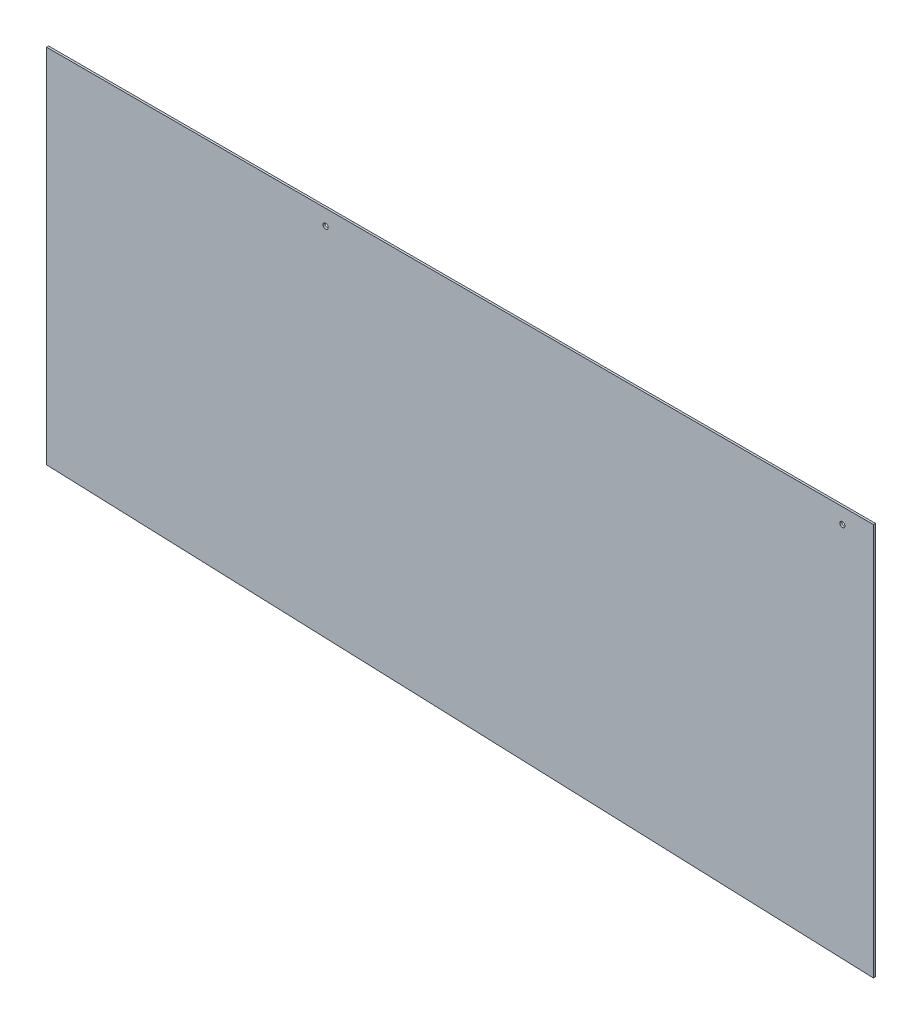
ISO-10303-21;
HEADER;
FILE_DESCRIPTION(('STEP AP214'),'2;1');
FILE_NAME('part.step','',(''),(''),'','','');
FILE_SCHEMA(('AUTOMOTIVE_DESIGN { 1 0 10303 214 1 1 1 1 }'));
ENDSEC;
DATA;
#1=APPLICATION_CONTEXT('core data for automotive mechanical design processes');
#2=APPLICATION_PROTOCOL_DEFINITION('international standard','automotive_design',2000,#1);
#3=PRODUCT_CONTEXT('',#1,'mechanical');
#4=PRODUCT('Part','Part','',(#3));
#5=PRODUCT_RELATED_PRODUCT_CATEGORY('part','',(#4));
#6=PRODUCT_DEFINITION_FORMATION('','',#4);
#7=PRODUCT_DEFINITION_CONTEXT('part definition',#1,'design');
#8=PRODUCT_DEFINITION('design','',#6,#7);
#9=PRODUCT_DEFINITION_SHAPE('','',#8);
#10=(LENGTH_UNIT() NAMED_UNIT(*) SI_UNIT(.MILLI.,.METRE.));
#11=(NAMED_UNIT(*) PLANE_ANGLE_UNIT() SI_UNIT($,.RADIAN.));
#12=(NAMED_UNIT(*) SI_UNIT($,.STERADIAN.) SOLID_ANGLE_UNIT());
#13=UNCERTAINTY_MEASURE_WITH_UNIT(LENGTH_MEASURE(1.E-05),#10,'distance_accuracy_value','');
#14=(GEOMETRIC_REPRESENTATION_CONTEXT(3) GLOBAL_UNCERTAINTY_ASSIGNED_CONTEXT((#13)) GLOBAL_UNIT_ASSIGNED_CONTEXT((#10,
#11,#12)) REPRESENTATION_CONTEXT('',''));
#15=CARTESIAN_POINT('',(0.,0.,0.));
#16=DIRECTION('',(0.,0.,1.));
#17=DIRECTION('',(1.,0.,0.));
#18=AXIS2_PLACEMENT_3D('',#15,#16,#17);
#19=CARTESIAN_POINT('',(0.,0.,0.2));
#20=DIRECTION('',(0.,0.,-1.));
#21=DIRECTION('',(-1.,0.,0.));
#22=AXIS2_PLACEMENT_3D('',#19,#20,#21);
#23=PLANE('',#22);
#24=CARTESIAN_POINT('',(-4.81258894362342,12.5444444444444,0.2));
#25=DIRECTION('',(0.,0.,1.));
#26=DIRECTION('',(1.,0.,0.));
#27=AXIS2_PLACEMENT_3D('',#24,#25,#26);
#28=CIRCLE('',#27,0.25);
#29=CARTESIAN_POINT('',(-4.56258894362342,12.5444444444444,0.2));
#30=VERTEX_POINT('',#29);
#31=EDGE_CURVE('E106',#30,#30,#28,.T.);
#32=ORIENTED_EDGE('',*,*,#31,.F.);
#33=EDGE_LOOP('',(#32));
#34=FACE_BOUND('',#33,.T.);
#35=DIRECTION('',(0.,-1.,0.));
#36=VECTOR('',#35,1.);
#37=CARTESIAN_POINT('',(-31.8125889436234,-20.9555555555556,0.2));
#38=LINE('',#37,#36);
#39=CARTESIAN_POINT('',(-31.8125889436234,14.0444444444444,0.2));
#40=VERTEX_POINT('',#39);
#41=CARTESIAN_POINT('',(-31.8125889436234,-20.9555555555556,0.2));
#42=VERTEX_POINT('',#41);
#43=EDGE_CURVE('E77',#40,#42,#38,.T.);
#44=ORIENTED_EDGE('',*,*,#43,.T.);
#45=DIRECTION('',(0.999297615709181,-0.0374736605890943,0.));
#46=VECTOR('',#45,1.);
#47=CARTESIAN_POINT('',(-31.8125889436234,-20.9555555555556,0.2));
#48=LINE('',#47,#46);
#49=CARTESIAN_POINT('',(48.1874110563766,-23.9555555555556,0.2));
#50=VERTEX_POINT('',#49);
#51=EDGE_CURVE('E81',#42,#50,#48,.T.);
#52=ORIENTED_EDGE('',*,*,#51,.T.);
#53=DIRECTION('',(0.,1.,0.));
#54=VECTOR('',#53,1.);
#55=CARTESIAN_POINT('',(48.1874110563766,14.0444444444444,0.2));
#56=LINE('',#55,#54);
#57=CARTESIAN_POINT('',(48.1874110563766,14.0444444444444,0.2));
#58=VERTEX_POINT('',#57);
#59=EDGE_CURVE('E84',#50,#58,#56,.T.);
#60=ORIENTED_EDGE('',*,*,#59,.T.);
#61=DIRECTION('',(-1.,0.,0.));
#62=VECTOR('',#61,1.);
#63=CARTESIAN_POINT('',(-31.8125889436234,14.0444444444444,0.2));
#64=LINE('',#63,#62);
#65=EDGE_CURVE('E50',#58,#40,#64,.T.);
#66=ORIENTED_EDGE('',*,*,#65,.T.);
#67=EDGE_LOOP('',(#44,#52,#60,#66));
#68=FACE_BOUND('',#67,.T.);
#69=CARTESIAN_POINT('',(45.1874110563766,12.5444444444444,0.2));
#70=DIRECTION('',(0.,0.,1.));
#71=DIRECTION('',(1.,0.,0.));
#72=AXIS2_PLACEMENT_3D('',#69,#70,#71);
#73=CIRCLE('',#72,0.25);
#74=CARTESIAN_POINT('',(45.4374110563766,12.5444444444444,0.2));
#75=VERTEX_POINT('',#74);
#76=EDGE_CURVE('E100',#75,#75,#73,.T.);
#77=ORIENTED_EDGE('',*,*,#76,.F.);
#78=EDGE_LOOP('',(#77));
#79=FACE_BOUND('',#78,.T.);
#80=ADVANCED_FACE('F33',(#34,#68,#79),#23,.F.);
#81=CARTESIAN_POINT('',(0.,0.,0.));
#82=DIRECTION('',(0.,0.,-1.));
#83=DIRECTION('',(-1.,0.,0.));
#84=AXIS2_PLACEMENT_3D('',#81,#82,#83);
#85=PLANE('',#84);
#86=CARTESIAN_POINT('',(-4.81258894362342,12.5444444444444,0.));
#87=DIRECTION('',(0.,0.,1.));
#88=DIRECTION('',(1.,0.,0.));
#89=AXIS2_PLACEMENT_3D('',#86,#87,#88);
#90=CIRCLE('',#89,0.25);
#91=CARTESIAN_POINT('',(-4.56258894362342,12.5444444444444,0.));
#92=VERTEX_POINT('',#91);
#93=EDGE_CURVE('E103',#92,#92,#90,.T.);
#94=ORIENTED_EDGE('',*,*,#93,.T.);
#95=EDGE_LOOP('',(#94));
#96=FACE_BOUND('',#95,.T.);
#97=DIRECTION('',(0.,-1.,0.));
#98=VECTOR('',#97,1.);
#99=CARTESIAN_POINT('',(-31.8125889436234,-20.9555555555556,0.));
#100=LINE('',#99,#98);
#101=CARTESIAN_POINT('',(-31.8125889436234,14.0444444444444,0.));
#102=VERTEX_POINT('',#101);
#103=CARTESIAN_POINT('',(-31.8125889436234,-20.9555555555556,0.));
#104=VERTEX_POINT('',#103);
#105=EDGE_CURVE('E88',#102,#104,#100,.T.);
#106=ORIENTED_EDGE('',*,*,#105,.F.);
#107=DIRECTION('',(-1.,0.,0.));
#108=VECTOR('',#107,1.);
#109=CARTESIAN_POINT('',(-31.8125889436234,14.0444444444444,0.));
#110=LINE('',#109,#108);
#111=CARTESIAN_POINT('',(48.1874110563766,14.0444444444444,0.));
#112=VERTEX_POINT('',#111);
#113=EDGE_CURVE('E85',#112,#102,#110,.T.);
#114=ORIENTED_EDGE('',*,*,#113,.F.);
#115=DIRECTION('',(0.,1.,0.));
#116=VECTOR('',#115,1.);
#117=CARTESIAN_POINT('',(48.1874110563766,14.0444444444444,0.));
#118=LINE('',#117,#116);
#119=CARTESIAN_POINT('',(48.1874110563766,-23.9555555555556,0.));
#120=VERTEX_POINT('',#119);
#121=EDGE_CURVE('E62',#120,#112,#118,.T.);
#122=ORIENTED_EDGE('',*,*,#121,.F.);
#123=DIRECTION('',(0.999297615709181,-0.0374736605890943,0.));
#124=VECTOR('',#123,1.);
#125=CARTESIAN_POINT('',(-31.8125889436234,-20.9555555555556,0.));
#126=LINE('',#125,#124);
#127=EDGE_CURVE('E94',#104,#120,#126,.T.);
#128=ORIENTED_EDGE('',*,*,#127,.F.);
#129=EDGE_LOOP('',(#106,#114,#122,#128));
#130=FACE_BOUND('',#129,.T.);
#131=CARTESIAN_POINT('',(45.1874110563766,12.5444444444444,0.));
#132=DIRECTION('',(0.,0.,1.));
#133=DIRECTION('',(1.,0.,0.));
#134=AXIS2_PLACEMENT_3D('',#131,#132,#133);
#135=CIRCLE('',#134,0.25);
#136=CARTESIAN_POINT('',(45.4374110563766,12.5444444444444,0.));
#137=VERTEX_POINT('',#136);
#138=EDGE_CURVE('E99',#137,#137,#135,.T.);
#139=ORIENTED_EDGE('',*,*,#138,.T.);
#140=EDGE_LOOP('',(#139));
#141=FACE_BOUND('',#140,.T.);
#142=ADVANCED_FACE('F119',(#96,#130,#141),#85,.T.);
#143=CARTESIAN_POINT('',(-31.8125889436234,-20.9555555555556,0.2));
#144=DIRECTION('',(1.,0.,0.));
#145=DIRECTION('',(0.,0.,-1.));
#146=AXIS2_PLACEMENT_3D('',#143,#144,#145);
#147=PLANE('',#146);
#148=ORIENTED_EDGE('',*,*,#105,.T.);
#149=DIRECTION('',(0.,0.,-1.));
#150=VECTOR('',#149,1.);
#151=CARTESIAN_POINT('',(-31.8125889436234,-20.9555555555556,0.2));
#152=LINE('',#151,#150);
#153=EDGE_CURVE('E11',#42,#104,#152,.T.);
#154=ORIENTED_EDGE('',*,*,#153,.F.);
#155=ORIENTED_EDGE('',*,*,#43,.F.);
#156=DIRECTION('',(0.,0.,-1.));
#157=VECTOR('',#156,1.);
#158=CARTESIAN_POINT('',(-31.8125889436234,14.0444444444444,0.2));
#159=LINE('',#158,#157);
#160=EDGE_CURVE('E113',#40,#102,#159,.T.);
#161=ORIENTED_EDGE('',*,*,#160,.T.);
#162=EDGE_LOOP('',(#148,#154,#155,#161));
#163=FACE_BOUND('',#162,.T.);
#164=ADVANCED_FACE('F35',(#163),#147,.F.);
#165=CARTESIAN_POINT('',(48.1874110563766,14.0444444444444,0.2));
#166=DIRECTION('',(-1.,0.,0.));
#167=DIRECTION('',(0.,0.,1.));
#168=AXIS2_PLACEMENT_3D('',#165,#166,#167);
#169=PLANE('',#168);
#170=ORIENTED_EDGE('',*,*,#121,.T.);
#171=DIRECTION('',(0.,0.,-1.));
#172=VECTOR('',#171,1.);
#173=CARTESIAN_POINT('',(48.1874110563766,14.0444444444444,0.2));
#174=LINE('',#173,#172);
#175=EDGE_CURVE('E42',#58,#112,#174,.T.);
#176=ORIENTED_EDGE('',*,*,#175,.F.);
#177=ORIENTED_EDGE('',*,*,#59,.F.);
#178=DIRECTION('',(0.,0.,1.));
#179=VECTOR('',#178,1.);
#180=CARTESIAN_POINT('',(48.1874110563766,-23.9555555555556,0.));
#181=LINE('',#180,#179);
#182=EDGE_CURVE('E93',#120,#50,#181,.T.);
#183=ORIENTED_EDGE('',*,*,#182,.F.);
#184=EDGE_LOOP('',(#170,#176,#177,#183));
#185=FACE_BOUND('',#184,.T.);
#186=ADVANCED_FACE('F146',(#185),#169,.F.);
#187=CARTESIAN_POINT('',(-31.8125889436234,14.0444444444444,0.2));
#188=DIRECTION('',(0.,-1.,0.));
#189=DIRECTION('',(0.,0.,-1.));
#190=AXIS2_PLACEMENT_3D('',#187,#188,#189);
#191=PLANE('',#190);
#192=ORIENTED_EDGE('',*,*,#113,.T.);
#193=ORIENTED_EDGE('',*,*,#160,.F.);
#194=ORIENTED_EDGE('',*,*,#65,.F.);
#195=ORIENTED_EDGE('',*,*,#175,.T.);
#196=EDGE_LOOP('',(#192,#193,#194,#195));
#197=FACE_BOUND('',#196,.T.);
#198=ADVANCED_FACE('F118',(#197),#191,.F.);
#199=CARTESIAN_POINT('',(-4.81258894362342,12.5444444444444,0.2));
#200=DIRECTION('',(0.,0.,-1.));
#201=DIRECTION('',(-1.,0.,0.));
#202=AXIS2_PLACEMENT_3D('',#199,#200,#201);
#203=CYLINDRICAL_SURFACE('',#202,0.25);
#204=ORIENTED_EDGE('',*,*,#31,.T.);
#205=EDGE_LOOP('',(#204));
#206=FACE_BOUND('',#205,.T.);
#207=ORIENTED_EDGE('',*,*,#93,.F.);
#208=EDGE_LOOP('',(#207));
#209=FACE_BOUND('',#208,.T.);
#210=ADVANCED_FACE('F128',(#206,#209),#203,.F.);
#211=CARTESIAN_POINT('',(45.1874110563766,12.5444444444444,0.2));
#212=DIRECTION('',(0.,0.,-1.));
#213=DIRECTION('',(-1.,0.,0.));
#214=AXIS2_PLACEMENT_3D('',#211,#212,#213);
#215=CYLINDRICAL_SURFACE('',#214,0.25);
#216=ORIENTED_EDGE('',*,*,#76,.T.);
#217=EDGE_LOOP('',(#216));
#218=FACE_BOUND('',#217,.T.);
#219=ORIENTED_EDGE('',*,*,#138,.F.);
#220=EDGE_LOOP('',(#219));
#221=FACE_BOUND('',#220,.T.);
#222=ADVANCED_FACE('F126',(#218,#221),#215,.F.);
#223=CARTESIAN_POINT('',(-31.8125889436234,-20.9555555555556,0.));
#224=DIRECTION('',(-0.0374736605890943,-0.999297615709181,0.));
#225=DIRECTION('',(0.999297615709181,-0.0374736605890943,0.));
#226=AXIS2_PLACEMENT_3D('',#223,#224,#225);
#227=PLANE('',#226);
#228=ORIENTED_EDGE('',*,*,#51,.F.);
#229=ORIENTED_EDGE('',*,*,#153,.T.);
#230=ORIENTED_EDGE('',*,*,#127,.T.);
#231=ORIENTED_EDGE('',*,*,#182,.T.);
#232=EDGE_LOOP('',(#228,#229,#230,#231));
#233=FACE_BOUND('',#232,.T.);
#234=ADVANCED_FACE('F92',(#233),#227,.T.);
#235=CLOSED_SHELL('',(#80,#142,#164,#186,#198,#210,#222,#234));
#236=MANIFOLD_SOLID_BREP('B2',#235);
#237=ADVANCED_BREP_SHAPE_REPRESENTATION('',(#18,#236),#14);
#238=SHAPE_DEFINITION_REPRESENTATION(#9,#237);
ENDSEC;
END-ISO-10303-21;
